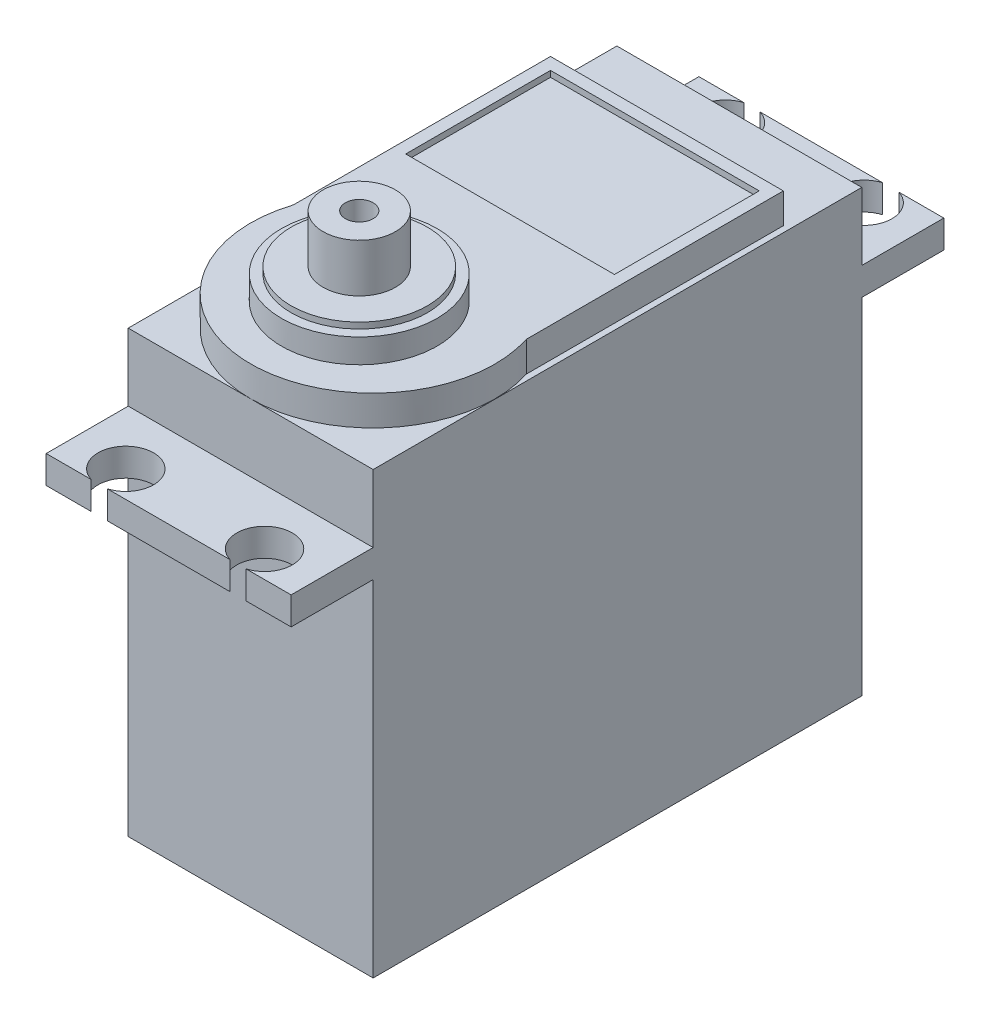
ISO-10303-21;
HEADER;
FILE_DESCRIPTION(('STEP AP214'),'2;1');
FILE_NAME('part.step','',(''),(''),'','','');
FILE_SCHEMA(('AUTOMOTIVE_DESIGN { 1 0 10303 214 1 1 1 1 }'));
ENDSEC;
DATA;
#1=APPLICATION_CONTEXT('core data for automotive mechanical design processes');
#2=APPLICATION_PROTOCOL_DEFINITION('international standard','automotive_design',2000,#1);
#3=PRODUCT_CONTEXT('',#1,'mechanical');
#4=PRODUCT('Part','Part','',(#3));
#5=PRODUCT_RELATED_PRODUCT_CATEGORY('part','',(#4));
#6=PRODUCT_DEFINITION_FORMATION('','',#4);
#7=PRODUCT_DEFINITION_CONTEXT('part definition',#1,'design');
#8=PRODUCT_DEFINITION('design','',#6,#7);
#9=PRODUCT_DEFINITION_SHAPE('','',#8);
#10=(LENGTH_UNIT() NAMED_UNIT(*) SI_UNIT(.MILLI.,.METRE.));
#11=(NAMED_UNIT(*) PLANE_ANGLE_UNIT() SI_UNIT($,.RADIAN.));
#12=(NAMED_UNIT(*) SI_UNIT($,.STERADIAN.) SOLID_ANGLE_UNIT());
#13=UNCERTAINTY_MEASURE_WITH_UNIT(LENGTH_MEASURE(1.E-05),#10,'distance_accuracy_value','');
#14=(GEOMETRIC_REPRESENTATION_CONTEXT(3) GLOBAL_UNCERTAINTY_ASSIGNED_CONTEXT((#13)) GLOBAL_UNIT_ASSIGNED_CONTEXT((#10,
#11,#12)) REPRESENTATION_CONTEXT('',''));
#15=CARTESIAN_POINT('',(0.,0.,0.));
#16=DIRECTION('',(0.,0.,1.));
#17=DIRECTION('',(1.,0.,0.));
#18=AXIS2_PLACEMENT_3D('',#15,#16,#17);
#19=CARTESIAN_POINT('',(-10.15,30.9,-27.05));
#20=DIRECTION('',(0.,-1.,0.));
#21=DIRECTION('',(0.,0.,-1.));
#22=AXIS2_PLACEMENT_3D('',#19,#20,#21);
#23=PLANE('',#22);
#24=DIRECTION('',(1.,0.,0.));
#25=VECTOR('',#24,1.);
#26=CARTESIAN_POINT('',(-10.15,30.9,-27.05));
#27=LINE('',#26,#25);
#28=CARTESIAN_POINT('',(-5.07917960675002,30.9,-27.05));
#29=VERTEX_POINT('',#28);
#30=CARTESIAN_POINT('',(5.07917960675007,30.9,-27.05));
#31=VERTEX_POINT('',#30);
#32=EDGE_CURVE('E347',#29,#31,#27,.T.);
#33=ORIENTED_EDGE('',*,*,#32,.F.);
#34=CARTESIAN_POINT('',(-5.74999999999999,30.9,-24.85));
#35=DIRECTION('',(0.,-1.,0.));
#36=DIRECTION('',(0.,0.,-1.));
#37=AXIS2_PLACEMENT_3D('',#34,#35,#36);
#38=CIRCLE('',#37,2.3);
#39=CARTESIAN_POINT('',(-6.42082039324996,30.9,-27.05));
#40=VERTEX_POINT('',#39);
#41=EDGE_CURVE('E311',#40,#29,#38,.F.);
#42=ORIENTED_EDGE('',*,*,#41,.F.);
#43=CARTESIAN_POINT('',(-10.15,30.9,-27.05));
#44=VERTEX_POINT('',#43);
#45=EDGE_CURVE('E343',#44,#40,#27,.T.);
#46=ORIENTED_EDGE('',*,*,#45,.F.);
#47=DIRECTION('',(0.,0.,1.));
#48=VECTOR('',#47,1.);
#49=CARTESIAN_POINT('',(-10.15,30.9,-27.05));
#50=LINE('',#49,#48);
#51=CARTESIAN_POINT('',(-10.15,30.9,-20.25));
#52=VERTEX_POINT('',#51);
#53=EDGE_CURVE('E352',#44,#52,#50,.T.);
#54=ORIENTED_EDGE('',*,*,#53,.T.);
#55=DIRECTION('',(1.,0.,0.));
#56=VECTOR('',#55,1.);
#57=CARTESIAN_POINT('',(-10.15,30.9,-20.25));
#58=LINE('',#57,#56);
#59=CARTESIAN_POINT('',(10.15,30.9,-20.25));
#60=VERTEX_POINT('',#59);
#61=EDGE_CURVE('E335',#52,#60,#58,.T.);
#62=ORIENTED_EDGE('',*,*,#61,.T.);
#63=DIRECTION('',(0.,0.,1.));
#64=VECTOR('',#63,1.);
#65=CARTESIAN_POINT('',(10.15,30.9,-27.05));
#66=LINE('',#65,#64);
#67=CARTESIAN_POINT('',(10.15,30.9,-27.05));
#68=VERTEX_POINT('',#67);
#69=EDGE_CURVE('E356',#68,#60,#66,.T.);
#70=ORIENTED_EDGE('',*,*,#69,.F.);
#71=CARTESIAN_POINT('',(6.42082039324993,30.9,-27.05));
#72=VERTEX_POINT('',#71);
#73=EDGE_CURVE('E342',#72,#68,#27,.T.);
#74=ORIENTED_EDGE('',*,*,#73,.F.);
#75=CARTESIAN_POINT('',(5.75,30.9,-24.85));
#76=DIRECTION('',(0.,-1.,0.));
#77=DIRECTION('',(0.,0.,-1.));
#78=AXIS2_PLACEMENT_3D('',#75,#76,#77);
#79=CIRCLE('',#78,2.3);
#80=EDGE_CURVE('E318',#72,#31,#79,.T.);
#81=ORIENTED_EDGE('',*,*,#80,.T.);
#82=EDGE_LOOP('',(#33,#42,#46,#54,#62,#70,#74,#81));
#83=FACE_BOUND('',#82,.T.);
#84=ADVANCED_FACE('F34',(#83),#23,.F.);
#85=CARTESIAN_POINT('',(10.15,28.6,-27.05));
#86=DIRECTION('',(0.,1.,0.));
#87=DIRECTION('',(0.,0.,1.));
#88=AXIS2_PLACEMENT_3D('',#85,#86,#87);
#89=PLANE('',#88);
#90=DIRECTION('',(-1.,0.,0.));
#91=VECTOR('',#90,1.);
#92=CARTESIAN_POINT('',(10.15,28.6,-27.05));
#93=LINE('',#92,#91);
#94=CARTESIAN_POINT('',(-6.42082039324996,28.6,-27.05));
#95=VERTEX_POINT('',#94);
#96=CARTESIAN_POINT('',(-10.15,28.6,-27.05));
#97=VERTEX_POINT('',#96);
#98=EDGE_CURVE('E334',#95,#97,#93,.T.);
#99=ORIENTED_EDGE('',*,*,#98,.F.);
#100=CARTESIAN_POINT('',(-5.74999999999999,28.6,-24.85));
#101=DIRECTION('',(0.,1.,0.));
#102=DIRECTION('',(0.,0.,1.));
#103=AXIS2_PLACEMENT_3D('',#100,#101,#102);
#104=CIRCLE('',#103,2.3);
#105=CARTESIAN_POINT('',(-5.07917960675002,28.6,-27.05));
#106=VERTEX_POINT('',#105);
#107=EDGE_CURVE('E315',#106,#95,#104,.F.);
#108=ORIENTED_EDGE('',*,*,#107,.F.);
#109=CARTESIAN_POINT('',(5.07917960675007,28.6,-27.05));
#110=VERTEX_POINT('',#109);
#111=EDGE_CURVE('E340',#110,#106,#93,.T.);
#112=ORIENTED_EDGE('',*,*,#111,.F.);
#113=CARTESIAN_POINT('',(5.75,28.6,-24.85));
#114=DIRECTION('',(0.,1.,0.));
#115=DIRECTION('',(0.,0.,1.));
#116=AXIS2_PLACEMENT_3D('',#113,#114,#115);
#117=CIRCLE('',#116,2.3);
#118=CARTESIAN_POINT('',(6.42082039324993,28.6,-27.05));
#119=VERTEX_POINT('',#118);
#120=EDGE_CURVE('E303',#110,#119,#117,.T.);
#121=ORIENTED_EDGE('',*,*,#120,.T.);
#122=CARTESIAN_POINT('',(10.15,28.6,-27.05));
#123=VERTEX_POINT('',#122);
#124=EDGE_CURVE('E336',#123,#119,#93,.T.);
#125=ORIENTED_EDGE('',*,*,#124,.F.);
#126=DIRECTION('',(0.,0.,1.));
#127=VECTOR('',#126,1.);
#128=CARTESIAN_POINT('',(10.15,28.6,-27.05));
#129=LINE('',#128,#127);
#130=CARTESIAN_POINT('',(10.15,28.6,-20.25));
#131=VERTEX_POINT('',#130);
#132=EDGE_CURVE('E359',#123,#131,#129,.T.);
#133=ORIENTED_EDGE('',*,*,#132,.T.);
#134=DIRECTION('',(-1.,0.,0.));
#135=VECTOR('',#134,1.);
#136=CARTESIAN_POINT('',(10.15,28.6,-20.25));
#137=LINE('',#136,#135);
#138=CARTESIAN_POINT('',(-10.15,28.6,-20.25));
#139=VERTEX_POINT('',#138);
#140=EDGE_CURVE('E313',#131,#139,#137,.T.);
#141=ORIENTED_EDGE('',*,*,#140,.T.);
#142=DIRECTION('',(0.,0.,1.));
#143=VECTOR('',#142,1.);
#144=CARTESIAN_POINT('',(-10.15,28.6,-27.05));
#145=LINE('',#144,#143);
#146=EDGE_CURVE('E346',#97,#139,#145,.T.);
#147=ORIENTED_EDGE('',*,*,#146,.F.);
#148=EDGE_LOOP('',(#99,#108,#112,#121,#125,#133,#141,#147));
#149=FACE_BOUND('',#148,.T.);
#150=ADVANCED_FACE('F474',(#149),#89,.F.);
#151=CARTESIAN_POINT('',(0.,0.,-27.05));
#152=DIRECTION('',(0.,0.,1.));
#153=DIRECTION('',(-1.,0.,0.));
#154=AXIS2_PLACEMENT_3D('',#151,#152,#153);
#155=PLANE('',#154);
#156=ORIENTED_EDGE('',*,*,#111,.T.);
#157=DIRECTION('',(0.,1.,0.));
#158=VECTOR('',#157,1.);
#159=CARTESIAN_POINT('',(-5.07917960675002,-0.00199999999999853,-27.05));
#160=LINE('',#159,#158);
#161=EDGE_CURVE('E317',#106,#29,#160,.T.);
#162=ORIENTED_EDGE('',*,*,#161,.T.);
#163=ORIENTED_EDGE('',*,*,#32,.T.);
#164=DIRECTION('',(0.,1.,0.));
#165=VECTOR('',#164,1.);
#166=CARTESIAN_POINT('',(5.07917960675007,-0.00199999999999853,-27.05));
#167=LINE('',#166,#165);
#168=EDGE_CURVE('E327',#110,#31,#167,.T.);
#169=ORIENTED_EDGE('',*,*,#168,.F.);
#170=EDGE_LOOP('',(#156,#162,#163,#169));
#171=FACE_BOUND('',#170,.T.);
#172=ADVANCED_FACE('F539',(#171),#155,.F.);
#173=DIRECTION('',(0.,1.,0.));
#174=VECTOR('',#173,1.);
#175=CARTESIAN_POINT('',(6.42082039324993,-0.00199999999999853,-27.05));
#176=LINE('',#175,#174);
#177=EDGE_CURVE('E324',#119,#72,#176,.T.);
#178=ORIENTED_EDGE('',*,*,#177,.T.);
#179=ORIENTED_EDGE('',*,*,#73,.T.);
#180=DIRECTION('',(0.,-1.,0.));
#181=VECTOR('',#180,1.);
#182=CARTESIAN_POINT('',(10.15,30.9,-27.05));
#183=LINE('',#182,#181);
#184=EDGE_CURVE('E339',#68,#123,#183,.T.);
#185=ORIENTED_EDGE('',*,*,#184,.T.);
#186=ORIENTED_EDGE('',*,*,#124,.T.);
#187=EDGE_LOOP('',(#178,#179,#185,#186));
#188=FACE_BOUND('',#187,.T.);
#189=ADVANCED_FACE('F479',(#188),#155,.F.);
#190=ORIENTED_EDGE('',*,*,#45,.T.);
#191=DIRECTION('',(0.,1.,0.));
#192=VECTOR('',#191,1.);
#193=CARTESIAN_POINT('',(-6.42082039324996,-0.00199999999999853,-27.05));
#194=LINE('',#193,#192);
#195=EDGE_CURVE('E314',#95,#40,#194,.T.);
#196=ORIENTED_EDGE('',*,*,#195,.F.);
#197=ORIENTED_EDGE('',*,*,#98,.T.);
#198=DIRECTION('',(0.,1.,0.));
#199=VECTOR('',#198,1.);
#200=CARTESIAN_POINT('',(-10.15,28.6,-27.05));
#201=LINE('',#200,#199);
#202=EDGE_CURVE('E331',#97,#44,#201,.T.);
#203=ORIENTED_EDGE('',*,*,#202,.T.);
#204=EDGE_LOOP('',(#190,#196,#197,#203));
#205=FACE_BOUND('',#204,.T.);
#206=ADVANCED_FACE('F799',(#205),#155,.F.);
#207=CARTESIAN_POINT('',(-10.15,36.5,-20.25));
#208=DIRECTION('',(0.,0.,1.));
#209=DIRECTION('',(1.,0.,0.));
#210=AXIS2_PLACEMENT_3D('',#207,#208,#209);
#211=PLANE('',#210);
#212=ORIENTED_EDGE('',*,*,#140,.F.);
#213=DIRECTION('',(0.,-1.,0.));
#214=VECTOR('',#213,1.);
#215=CARTESIAN_POINT('',(10.15,36.5,-20.25));
#216=LINE('',#215,#214);
#217=CARTESIAN_POINT('',(10.15,0.,-20.25));
#218=VERTEX_POINT('',#217);
#219=EDGE_CURVE('E447',#131,#218,#216,.T.);
#220=ORIENTED_EDGE('',*,*,#219,.T.);
#221=DIRECTION('',(-1.,0.,0.));
#222=VECTOR('',#221,1.);
#223=CARTESIAN_POINT('',(-10.15,0.,-20.25));
#224=LINE('',#223,#222);
#225=CARTESIAN_POINT('',(-10.15,0.,-20.25));
#226=VERTEX_POINT('',#225);
#227=EDGE_CURVE('E429',#218,#226,#224,.T.);
#228=ORIENTED_EDGE('',*,*,#227,.T.);
#229=DIRECTION('',(0.,-1.,0.));
#230=VECTOR('',#229,1.);
#231=CARTESIAN_POINT('',(-10.15,36.5,-20.25));
#232=LINE('',#231,#230);
#233=EDGE_CURVE('E444',#139,#226,#232,.T.);
#234=ORIENTED_EDGE('',*,*,#233,.F.);
#235=EDGE_LOOP('',(#212,#220,#228,#234));
#236=FACE_BOUND('',#235,.T.);
#237=ADVANCED_FACE('F454',(#236),#211,.F.);
#238=ORIENTED_EDGE('',*,*,#61,.F.);
#239=CARTESIAN_POINT('',(-10.15,36.5,-20.25));
#240=VERTEX_POINT('',#239);
#241=EDGE_CURVE('E445',#240,#52,#232,.T.);
#242=ORIENTED_EDGE('',*,*,#241,.F.);
#243=DIRECTION('',(-1.,0.,0.));
#244=VECTOR('',#243,1.);
#245=CARTESIAN_POINT('',(-10.15,36.5,-20.25));
#246=LINE('',#245,#244);
#247=CARTESIAN_POINT('',(10.15,36.5,-20.25));
#248=VERTEX_POINT('',#247);
#249=EDGE_CURVE('E417',#248,#240,#246,.T.);
#250=ORIENTED_EDGE('',*,*,#249,.F.);
#251=EDGE_CURVE('E448',#248,#60,#216,.T.);
#252=ORIENTED_EDGE('',*,*,#251,.T.);
#253=EDGE_LOOP('',(#238,#242,#250,#252));
#254=FACE_BOUND('',#253,.T.);
#255=ADVANCED_FACE('F485',(#254),#211,.F.);
#256=CARTESIAN_POINT('',(10.15,28.6,27.05));
#257=DIRECTION('',(0.,-1.,0.));
#258=DIRECTION('',(0.,0.,-1.));
#259=AXIS2_PLACEMENT_3D('',#256,#257,#258);
#260=PLANE('',#259);
#261=DIRECTION('',(-1.,0.,0.));
#262=VECTOR('',#261,1.);
#263=CARTESIAN_POINT('',(10.15,28.6,27.05));
#264=LINE('',#263,#262);
#265=CARTESIAN_POINT('',(5.07917960675007,28.6,27.05));
#266=VERTEX_POINT('',#265);
#267=CARTESIAN_POINT('',(-5.07917960675003,28.6,27.05));
#268=VERTEX_POINT('',#267);
#269=EDGE_CURVE('E401',#266,#268,#264,.T.);
#270=ORIENTED_EDGE('',*,*,#269,.T.);
#271=CARTESIAN_POINT('',(-5.74999999999999,28.6,24.85));
#272=DIRECTION('',(0.,-1.,0.));
#273=DIRECTION('',(0.,0.,-1.));
#274=AXIS2_PLACEMENT_3D('',#271,#272,#273);
#275=CIRCLE('',#274,2.3);
#276=CARTESIAN_POINT('',(-6.42082039324996,28.6,27.05));
#277=VERTEX_POINT('',#276);
#278=EDGE_CURVE('E369',#277,#268,#275,.T.);
#279=ORIENTED_EDGE('',*,*,#278,.F.);
#280=CARTESIAN_POINT('',(-10.15,28.6,27.05));
#281=VERTEX_POINT('',#280);
#282=EDGE_CURVE('E396',#277,#281,#264,.T.);
#283=ORIENTED_EDGE('',*,*,#282,.T.);
#284=DIRECTION('',(0.,0.,-1.));
#285=VECTOR('',#284,1.);
#286=CARTESIAN_POINT('',(-10.15,28.6,27.05));
#287=LINE('',#286,#285);
#288=CARTESIAN_POINT('',(-10.15,28.6,20.25));
#289=VERTEX_POINT('',#288);
#290=EDGE_CURVE('E406',#281,#289,#287,.T.);
#291=ORIENTED_EDGE('',*,*,#290,.T.);
#292=DIRECTION('',(-1.,0.,0.));
#293=VECTOR('',#292,1.);
#294=CARTESIAN_POINT('',(10.15,28.6,20.25));
#295=LINE('',#294,#293);
#296=CARTESIAN_POINT('',(10.15,28.6,20.25));
#297=VERTEX_POINT('',#296);
#298=EDGE_CURVE('E388',#297,#289,#295,.T.);
#299=ORIENTED_EDGE('',*,*,#298,.F.);
#300=DIRECTION('',(0.,0.,-1.));
#301=VECTOR('',#300,1.);
#302=CARTESIAN_POINT('',(10.15,28.6,27.05));
#303=LINE('',#302,#301);
#304=CARTESIAN_POINT('',(10.15,28.6,27.05));
#305=VERTEX_POINT('',#304);
#306=EDGE_CURVE('E409',#305,#297,#303,.T.);
#307=ORIENTED_EDGE('',*,*,#306,.F.);
#308=CARTESIAN_POINT('',(6.42082039324993,28.6,27.05));
#309=VERTEX_POINT('',#308);
#310=EDGE_CURVE('E397',#305,#309,#264,.T.);
#311=ORIENTED_EDGE('',*,*,#310,.T.);
#312=CARTESIAN_POINT('',(5.75,28.6,24.85));
#313=DIRECTION('',(0.,-1.,0.));
#314=DIRECTION('',(0.,0.,-1.));
#315=AXIS2_PLACEMENT_3D('',#312,#313,#314);
#316=CIRCLE('',#315,2.3);
#317=EDGE_CURVE('E355',#309,#266,#316,.F.);
#318=ORIENTED_EDGE('',*,*,#317,.T.);
#319=EDGE_LOOP('',(#270,#279,#283,#291,#299,#307,#311,#318));
#320=FACE_BOUND('',#319,.T.);
#321=ADVANCED_FACE('F516',(#320),#260,.T.);
#322=CARTESIAN_POINT('',(-10.15,30.9,27.05));
#323=DIRECTION('',(0.,1.,0.));
#324=DIRECTION('',(0.,0.,1.));
#325=AXIS2_PLACEMENT_3D('',#322,#323,#324);
#326=PLANE('',#325);
#327=DIRECTION('',(1.,0.,0.));
#328=VECTOR('',#327,1.);
#329=CARTESIAN_POINT('',(-10.15,30.9,27.05));
#330=LINE('',#329,#328);
#331=CARTESIAN_POINT('',(-10.15,30.9,27.05));
#332=VERTEX_POINT('',#331);
#333=CARTESIAN_POINT('',(-6.42082039324996,30.9,27.05));
#334=VERTEX_POINT('',#333);
#335=EDGE_CURVE('E389',#332,#334,#330,.T.);
#336=ORIENTED_EDGE('',*,*,#335,.T.);
#337=CARTESIAN_POINT('',(-5.74999999999999,30.9,24.85));
#338=DIRECTION('',(0.,1.,0.));
#339=DIRECTION('',(0.,0.,1.));
#340=AXIS2_PLACEMENT_3D('',#337,#338,#339);
#341=CIRCLE('',#340,2.3);
#342=CARTESIAN_POINT('',(-5.07917960675002,30.9,27.05));
#343=VERTEX_POINT('',#342);
#344=EDGE_CURVE('E364',#334,#343,#341,.F.);
#345=ORIENTED_EDGE('',*,*,#344,.T.);
#346=CARTESIAN_POINT('',(5.07917960675007,30.9,27.05));
#347=VERTEX_POINT('',#346);
#348=EDGE_CURVE('E393',#343,#347,#330,.T.);
#349=ORIENTED_EDGE('',*,*,#348,.T.);
#350=CARTESIAN_POINT('',(5.75,30.9,24.85));
#351=DIRECTION('',(0.,1.,0.));
#352=DIRECTION('',(0.,0.,1.));
#353=AXIS2_PLACEMENT_3D('',#350,#351,#352);
#354=CIRCLE('',#353,2.3);
#355=CARTESIAN_POINT('',(6.42082039324993,30.9,27.05));
#356=VERTEX_POINT('',#355);
#357=EDGE_CURVE('E372',#356,#347,#354,.T.);
#358=ORIENTED_EDGE('',*,*,#357,.F.);
#359=CARTESIAN_POINT('',(10.15,30.9,27.05));
#360=VERTEX_POINT('',#359);
#361=EDGE_CURVE('E387',#356,#360,#330,.T.);
#362=ORIENTED_EDGE('',*,*,#361,.T.);
#363=DIRECTION('',(0.,0.,-1.));
#364=VECTOR('',#363,1.);
#365=CARTESIAN_POINT('',(10.15,30.9,27.05));
#366=LINE('',#365,#364);
#367=CARTESIAN_POINT('',(10.15,30.9,20.25));
#368=VERTEX_POINT('',#367);
#369=EDGE_CURVE('E411',#360,#368,#366,.T.);
#370=ORIENTED_EDGE('',*,*,#369,.T.);
#371=DIRECTION('',(1.,0.,0.));
#372=VECTOR('',#371,1.);
#373=CARTESIAN_POINT('',(-10.15,30.9,20.25));
#374=LINE('',#373,#372);
#375=CARTESIAN_POINT('',(-10.15,30.9,20.25));
#376=VERTEX_POINT('',#375);
#377=EDGE_CURVE('E367',#376,#368,#374,.T.);
#378=ORIENTED_EDGE('',*,*,#377,.F.);
#379=DIRECTION('',(0.,0.,-1.));
#380=VECTOR('',#379,1.);
#381=CARTESIAN_POINT('',(-10.15,30.9,27.05));
#382=LINE('',#381,#380);
#383=EDGE_CURVE('E400',#332,#376,#382,.T.);
#384=ORIENTED_EDGE('',*,*,#383,.F.);
#385=EDGE_LOOP('',(#336,#345,#349,#358,#362,#370,#378,#384));
#386=FACE_BOUND('',#385,.T.);
#387=ADVANCED_FACE('F500',(#386),#326,.T.);
#388=CARTESIAN_POINT('',(0.,0.,27.05));
#389=DIRECTION('',(0.,0.,-1.));
#390=DIRECTION('',(-1.,0.,0.));
#391=AXIS2_PLACEMENT_3D('',#388,#389,#390);
#392=PLANE('',#391);
#393=DIRECTION('',(0.,1.,0.));
#394=VECTOR('',#393,1.);
#395=CARTESIAN_POINT('',(-6.42082039324996,-0.00199999999999853,27.05));
#396=LINE('',#395,#394);
#397=EDGE_CURVE('E371',#277,#334,#396,.T.);
#398=ORIENTED_EDGE('',*,*,#397,.T.);
#399=ORIENTED_EDGE('',*,*,#335,.F.);
#400=DIRECTION('',(0.,1.,0.));
#401=VECTOR('',#400,1.);
#402=CARTESIAN_POINT('',(-10.15,28.6,27.05));
#403=LINE('',#402,#401);
#404=EDGE_CURVE('E384',#281,#332,#403,.T.);
#405=ORIENTED_EDGE('',*,*,#404,.F.);
#406=ORIENTED_EDGE('',*,*,#282,.F.);
#407=EDGE_LOOP('',(#398,#399,#405,#406));
#408=FACE_BOUND('',#407,.T.);
#409=ADVANCED_FACE('F522',(#408),#392,.F.);
#410=DIRECTION('',(0.,1.,0.));
#411=VECTOR('',#410,1.);
#412=CARTESIAN_POINT('',(-5.07917960675002,-0.00199999999999853,27.05));
#413=LINE('',#412,#411);
#414=EDGE_CURVE('E368',#268,#343,#413,.T.);
#415=ORIENTED_EDGE('',*,*,#414,.F.);
#416=ORIENTED_EDGE('',*,*,#269,.F.);
#417=DIRECTION('',(0.,1.,0.));
#418=VECTOR('',#417,1.);
#419=CARTESIAN_POINT('',(5.07917960675007,-0.00199999999999853,27.05));
#420=LINE('',#419,#418);
#421=EDGE_CURVE('E377',#266,#347,#420,.T.);
#422=ORIENTED_EDGE('',*,*,#421,.T.);
#423=ORIENTED_EDGE('',*,*,#348,.F.);
#424=EDGE_LOOP('',(#415,#416,#422,#423));
#425=FACE_BOUND('',#424,.T.);
#426=ADVANCED_FACE('F510',(#425),#392,.F.);
#427=CARTESIAN_POINT('',(-10.15,36.5,20.25));
#428=DIRECTION('',(0.,0.,-1.));
#429=DIRECTION('',(-1.,0.,0.));
#430=AXIS2_PLACEMENT_3D('',#427,#428,#429);
#431=PLANE('',#430);
#432=DIRECTION('',(0.,-1.,0.));
#433=VECTOR('',#432,1.);
#434=CARTESIAN_POINT('',(-10.15,36.5,20.25));
#435=LINE('',#434,#433);
#436=CARTESIAN_POINT('',(-10.15,36.5,20.25));
#437=VERTEX_POINT('',#436);
#438=EDGE_CURVE('E441',#437,#376,#435,.T.);
#439=ORIENTED_EDGE('',*,*,#438,.T.);
#440=ORIENTED_EDGE('',*,*,#377,.T.);
#441=DIRECTION('',(0.,-1.,0.));
#442=VECTOR('',#441,1.);
#443=CARTESIAN_POINT('',(10.15,36.5,20.25));
#444=LINE('',#443,#442);
#445=CARTESIAN_POINT('',(10.15,36.5,20.25));
#446=VERTEX_POINT('',#445);
#447=EDGE_CURVE('E437',#446,#368,#444,.T.);
#448=ORIENTED_EDGE('',*,*,#447,.F.);
#449=DIRECTION('',(1.,0.,0.));
#450=VECTOR('',#449,1.);
#451=CARTESIAN_POINT('',(-10.15,36.5,20.25));
#452=LINE('',#451,#450);
#453=CARTESIAN_POINT('',(0.,36.5,20.25));
#454=VERTEX_POINT('',#453);
#455=EDGE_CURVE('E422',#454,#446,#452,.T.);
#456=ORIENTED_EDGE('',*,*,#455,.F.);
#457=EDGE_CURVE('E423',#437,#454,#452,.T.);
#458=ORIENTED_EDGE('',*,*,#457,.F.);
#459=EDGE_LOOP('',(#439,#440,#448,#456,#458));
#460=FACE_BOUND('',#459,.T.);
#461=ADVANCED_FACE('F497',(#460),#431,.F.);
#462=CARTESIAN_POINT('',(10.15,36.5,20.25));
#463=DIRECTION('',(-1.,0.,0.));
#464=DIRECTION('',(0.,0.,1.));
#465=AXIS2_PLACEMENT_3D('',#462,#463,#464);
#466=PLANE('',#465);
#467=DIRECTION('',(0.,0.,-1.));
#468=VECTOR('',#467,1.);
#469=CARTESIAN_POINT('',(10.15,0.,20.25));
#470=LINE('',#469,#468);
#471=CARTESIAN_POINT('',(10.15,0.,20.25));
#472=VERTEX_POINT('',#471);
#473=EDGE_CURVE('E408',#472,#218,#470,.T.);
#474=ORIENTED_EDGE('',*,*,#473,.T.);
#475=ORIENTED_EDGE('',*,*,#219,.F.);
#476=ORIENTED_EDGE('',*,*,#132,.F.);
#477=ORIENTED_EDGE('',*,*,#184,.F.);
#478=ORIENTED_EDGE('',*,*,#69,.T.);
#479=ORIENTED_EDGE('',*,*,#251,.F.);
#480=DIRECTION('',(0.,0.,-1.));
#481=VECTOR('',#480,1.);
#482=CARTESIAN_POINT('',(10.15,36.5,20.25));
#483=LINE('',#482,#481);
#484=EDGE_CURVE('E414',#446,#248,#483,.T.);
#485=ORIENTED_EDGE('',*,*,#484,.F.);
#486=ORIENTED_EDGE('',*,*,#447,.T.);
#487=ORIENTED_EDGE('',*,*,#369,.F.);
#488=DIRECTION('',(0.,-1.,0.));
#489=VECTOR('',#488,1.);
#490=CARTESIAN_POINT('',(10.15,30.9,27.05));
#491=LINE('',#490,#489);
#492=EDGE_CURVE('E392',#360,#305,#491,.T.);
#493=ORIENTED_EDGE('',*,*,#492,.T.);
#494=ORIENTED_EDGE('',*,*,#306,.T.);
#495=EDGE_CURVE('E426',#297,#472,#444,.T.);
#496=ORIENTED_EDGE('',*,*,#495,.T.);
#497=EDGE_LOOP('',(#474,#475,#476,#477,#478,#479,#485,#486,#487,#493,#494,#496));
#498=FACE_BOUND('',#497,.T.);
#499=ADVANCED_FACE('F36',(#498),#466,.F.);
#500=CARTESIAN_POINT('',(-10.15,36.5,20.25));
#501=DIRECTION('',(1.,0.,0.));
#502=DIRECTION('',(0.,0.,-1.));
#503=AXIS2_PLACEMENT_3D('',#500,#501,#502);
#504=PLANE('',#503);
#505=DIRECTION('',(0.,0.,1.));
#506=VECTOR('',#505,1.);
#507=CARTESIAN_POINT('',(-10.15,0.,20.25));
#508=LINE('',#507,#506);
#509=CARTESIAN_POINT('',(-10.15,0.,20.25));
#510=VERTEX_POINT('',#509);
#511=EDGE_CURVE('E432',#226,#510,#508,.T.);
#512=ORIENTED_EDGE('',*,*,#511,.T.);
#513=EDGE_CURVE('E440',#289,#510,#435,.T.);
#514=ORIENTED_EDGE('',*,*,#513,.F.);
#515=ORIENTED_EDGE('',*,*,#290,.F.);
#516=ORIENTED_EDGE('',*,*,#404,.T.);
#517=ORIENTED_EDGE('',*,*,#383,.T.);
#518=ORIENTED_EDGE('',*,*,#438,.F.);
#519=DIRECTION('',(0.,0.,1.));
#520=VECTOR('',#519,1.);
#521=CARTESIAN_POINT('',(-10.15,36.5,20.25));
#522=LINE('',#521,#520);
#523=EDGE_CURVE('E420',#240,#437,#522,.T.);
#524=ORIENTED_EDGE('',*,*,#523,.F.);
#525=ORIENTED_EDGE('',*,*,#241,.T.);
#526=ORIENTED_EDGE('',*,*,#53,.F.);
#527=ORIENTED_EDGE('',*,*,#202,.F.);
#528=ORIENTED_EDGE('',*,*,#146,.T.);
#529=ORIENTED_EDGE('',*,*,#233,.T.);
#530=EDGE_LOOP('',(#512,#514,#515,#516,#517,#518,#524,#525,#526,#527,#528,#529));
#531=FACE_BOUND('',#530,.T.);
#532=ADVANCED_FACE('F469',(#531),#504,.F.);
#533=ORIENTED_EDGE('',*,*,#495,.F.);
#534=ORIENTED_EDGE('',*,*,#298,.T.);
#535=ORIENTED_EDGE('',*,*,#513,.T.);
#536=DIRECTION('',(1.,0.,0.));
#537=VECTOR('',#536,1.);
#538=CARTESIAN_POINT('',(-10.15,0.,20.25));
#539=LINE('',#538,#537);
#540=EDGE_CURVE('E418',#510,#472,#539,.T.);
#541=ORIENTED_EDGE('',*,*,#540,.T.);
#542=EDGE_LOOP('',(#533,#534,#535,#541));
#543=FACE_BOUND('',#542,.T.);
#544=ADVANCED_FACE('F465',(#543),#431,.F.);
#545=CARTESIAN_POINT('',(0.,36.5,0.));
#546=DIRECTION('',(0.,-1.,0.));
#547=DIRECTION('',(0.,0.,-1.));
#548=AXIS2_PLACEMENT_3D('',#545,#546,#547);
#549=PLANE('',#548);
#550=DIRECTION('',(-1.,0.,0.));
#551=VECTOR('',#550,1.);
#552=CARTESIAN_POINT('',(9.65,36.5,-14.25));
#553=LINE('',#552,#551);
#554=CARTESIAN_POINT('',(9.65,36.5,-14.25));
#555=VERTEX_POINT('',#554);
#556=CARTESIAN_POINT('',(-9.65,36.5,-14.25));
#557=VERTEX_POINT('',#556);
#558=EDGE_CURVE('E283',#555,#557,#553,.T.);
#559=ORIENTED_EDGE('',*,*,#558,.F.);
#560=DIRECTION('',(0.,0.,1.));
#561=VECTOR('',#560,1.);
#562=CARTESIAN_POINT('',(9.65,36.5,-14.25));
#563=LINE('',#562,#561);
#564=CARTESIAN_POINT('',(9.65,36.5,7.05));
#565=VERTEX_POINT('',#564);
#566=EDGE_CURVE('E59',#555,#565,#563,.T.);
#567=ORIENTED_EDGE('',*,*,#566,.T.);
#568=CARTESIAN_POINT('',(0.,36.5,10.1226325757576));
#569=DIRECTION('',(0.,-1.,0.));
#570=DIRECTION('',(0.,0.,-1.));
#571=AXIS2_PLACEMENT_3D('',#568,#569,#570);
#572=CIRCLE('',#571,10.1273674242424);
#573=EDGE_CURVE('E292',#565,#454,#572,.T.);
#574=ORIENTED_EDGE('',*,*,#573,.T.);
#575=ORIENTED_EDGE('',*,*,#455,.T.);
#576=ORIENTED_EDGE('',*,*,#484,.T.);
#577=ORIENTED_EDGE('',*,*,#249,.T.);
#578=ORIENTED_EDGE('',*,*,#523,.T.);
#579=ORIENTED_EDGE('',*,*,#457,.T.);
#580=CARTESIAN_POINT('',(-9.65,36.5,7.05));
#581=VERTEX_POINT('',#580);
#582=EDGE_CURVE('E295',#454,#581,#572,.T.);
#583=ORIENTED_EDGE('',*,*,#582,.T.);
#584=DIRECTION('',(0.,0.,1.));
#585=VECTOR('',#584,1.);
#586=CARTESIAN_POINT('',(-9.65,36.5,-14.25));
#587=LINE('',#586,#585);
#588=EDGE_CURVE('E294',#557,#581,#587,.T.);
#589=ORIENTED_EDGE('',*,*,#588,.F.);
#590=EDGE_LOOP('',(#559,#567,#574,#575,#576,#577,#578,#579,#583,#589));
#591=FACE_BOUND('',#590,.T.);
#592=ADVANCED_FACE('F489',(#591),#549,.F.);
#593=CARTESIAN_POINT('',(0.,0.,0.));
#594=DIRECTION('',(0.,-1.,0.));
#595=DIRECTION('',(0.,0.,-1.));
#596=AXIS2_PLACEMENT_3D('',#593,#594,#595);
#597=PLANE('',#596);
#598=ORIENTED_EDGE('',*,*,#473,.F.);
#599=ORIENTED_EDGE('',*,*,#540,.F.);
#600=ORIENTED_EDGE('',*,*,#511,.F.);
#601=ORIENTED_EDGE('',*,*,#227,.F.);
#602=EDGE_LOOP('',(#598,#599,#600,#601));
#603=FACE_BOUND('',#602,.T.);
#604=ADVANCED_FACE('F460',(#603),#597,.T.);
#605=ORIENTED_EDGE('',*,*,#361,.F.);
#606=DIRECTION('',(0.,1.,0.));
#607=VECTOR('',#606,1.);
#608=CARTESIAN_POINT('',(6.42082039324993,-0.00199999999999853,27.05));
#609=LINE('',#608,#607);
#610=EDGE_CURVE('E380',#309,#356,#609,.T.);
#611=ORIENTED_EDGE('',*,*,#610,.F.);
#612=ORIENTED_EDGE('',*,*,#310,.F.);
#613=ORIENTED_EDGE('',*,*,#492,.F.);
#614=EDGE_LOOP('',(#605,#611,#612,#613));
#615=FACE_BOUND('',#614,.T.);
#616=ADVANCED_FACE('F519',(#615),#392,.F.);
#617=CARTESIAN_POINT('',(5.75,-0.00199999999999853,24.85));
#618=DIRECTION('',(0.,1.,0.));
#619=DIRECTION('',(0.,0.,1.));
#620=AXIS2_PLACEMENT_3D('',#617,#618,#619);
#621=CYLINDRICAL_SURFACE('',#620,2.3);
#622=ORIENTED_EDGE('',*,*,#610,.T.);
#623=ORIENTED_EDGE('',*,*,#357,.T.);
#624=ORIENTED_EDGE('',*,*,#421,.F.);
#625=ORIENTED_EDGE('',*,*,#317,.F.);
#626=EDGE_LOOP('',(#622,#623,#624,#625));
#627=FACE_BOUND('',#626,.T.);
#628=ADVANCED_FACE('F514',(#627),#621,.F.);
#629=CARTESIAN_POINT('',(-5.74999999999999,-0.00199999999999853,24.85));
#630=DIRECTION('',(0.,1.,0.));
#631=DIRECTION('',(0.,0.,1.));
#632=AXIS2_PLACEMENT_3D('',#629,#630,#631);
#633=CYLINDRICAL_SURFACE('',#632,2.3);
#634=ORIENTED_EDGE('',*,*,#278,.T.);
#635=ORIENTED_EDGE('',*,*,#414,.T.);
#636=ORIENTED_EDGE('',*,*,#344,.F.);
#637=ORIENTED_EDGE('',*,*,#397,.F.);
#638=EDGE_LOOP('',(#634,#635,#636,#637));
#639=FACE_BOUND('',#638,.T.);
#640=ADVANCED_FACE('F527',(#639),#633,.F.);
#641=CARTESIAN_POINT('',(5.75,-0.00199999999999853,-24.85));
#642=DIRECTION('',(0.,1.,0.));
#643=DIRECTION('',(0.,0.,1.));
#644=AXIS2_PLACEMENT_3D('',#641,#642,#643);
#645=CYLINDRICAL_SURFACE('',#644,2.3);
#646=ORIENTED_EDGE('',*,*,#168,.T.);
#647=ORIENTED_EDGE('',*,*,#80,.F.);
#648=ORIENTED_EDGE('',*,*,#177,.F.);
#649=ORIENTED_EDGE('',*,*,#120,.F.);
#650=EDGE_LOOP('',(#646,#647,#648,#649));
#651=FACE_BOUND('',#650,.T.);
#652=ADVANCED_FACE('F545',(#651),#645,.F.);
#653=CARTESIAN_POINT('',(-5.74999999999999,-0.00199999999999853,-24.85));
#654=DIRECTION('',(0.,1.,0.));
#655=DIRECTION('',(0.,0.,1.));
#656=AXIS2_PLACEMENT_3D('',#653,#654,#655);
#657=CYLINDRICAL_SURFACE('',#656,2.3);
#658=ORIENTED_EDGE('',*,*,#107,.T.);
#659=ORIENTED_EDGE('',*,*,#195,.T.);
#660=ORIENTED_EDGE('',*,*,#41,.T.);
#661=ORIENTED_EDGE('',*,*,#161,.F.);
#662=EDGE_LOOP('',(#658,#659,#660,#661));
#663=FACE_BOUND('',#662,.T.);
#664=ADVANCED_FACE('F550',(#663),#657,.F.);
#665=CARTESIAN_POINT('',(9.65,39.,-14.25));
#666=DIRECTION('',(1.,0.,0.));
#667=DIRECTION('',(0.,0.,-1.));
#668=AXIS2_PLACEMENT_3D('',#665,#666,#667);
#669=PLANE('',#668);
#670=ORIENTED_EDGE('',*,*,#566,.F.);
#671=DIRECTION('',(0.,-1.,0.));
#672=VECTOR('',#671,1.);
#673=CARTESIAN_POINT('',(9.65,39.,-14.25));
#674=LINE('',#673,#672);
#675=CARTESIAN_POINT('',(9.65,39.,-14.25));
#676=VERTEX_POINT('',#675);
#677=EDGE_CURVE('E300',#676,#555,#674,.T.);
#678=ORIENTED_EDGE('',*,*,#677,.F.);
#679=DIRECTION('',(0.,0.,1.));
#680=VECTOR('',#679,1.);
#681=CARTESIAN_POINT('',(9.65,39.,-14.25));
#682=LINE('',#681,#680);
#683=CARTESIAN_POINT('',(9.65,39.,7.05));
#684=VERTEX_POINT('',#683);
#685=EDGE_CURVE('E279',#676,#684,#682,.T.);
#686=ORIENTED_EDGE('',*,*,#685,.T.);
#687=DIRECTION('',(0.,-1.,0.));
#688=VECTOR('',#687,1.);
#689=CARTESIAN_POINT('',(9.65,39.,7.05));
#690=LINE('',#689,#688);
#691=EDGE_CURVE('E290',#684,#565,#690,.T.);
#692=ORIENTED_EDGE('',*,*,#691,.T.);
#693=EDGE_LOOP('',(#670,#678,#686,#692));
#694=FACE_BOUND('',#693,.T.);
#695=ADVANCED_FACE('F557',(#694),#669,.T.);
#696=CARTESIAN_POINT('',(9.65,39.,-14.25));
#697=DIRECTION('',(0.,0.,1.));
#698=DIRECTION('',(1.,0.,0.));
#699=AXIS2_PLACEMENT_3D('',#696,#697,#698);
#700=PLANE('',#699);
#701=ORIENTED_EDGE('',*,*,#558,.T.);
#702=DIRECTION('',(0.,-1.,0.));
#703=VECTOR('',#702,1.);
#704=CARTESIAN_POINT('',(-9.65,39.,-14.25));
#705=LINE('',#704,#703);
#706=CARTESIAN_POINT('',(-9.65,39.,-14.25));
#707=VERTEX_POINT('',#706);
#708=EDGE_CURVE('E304',#707,#557,#705,.T.);
#709=ORIENTED_EDGE('',*,*,#708,.F.);
#710=DIRECTION('',(-1.,0.,0.));
#711=VECTOR('',#710,1.);
#712=CARTESIAN_POINT('',(9.65,39.,-14.25));
#713=LINE('',#712,#711);
#714=EDGE_CURVE('E288',#676,#707,#713,.T.);
#715=ORIENTED_EDGE('',*,*,#714,.F.);
#716=ORIENTED_EDGE('',*,*,#677,.T.);
#717=EDGE_LOOP('',(#701,#709,#715,#716));
#718=FACE_BOUND('',#717,.T.);
#719=ADVANCED_FACE('F563',(#718),#700,.F.);
#720=CARTESIAN_POINT('',(-9.65,39.,-14.25));
#721=DIRECTION('',(1.,0.,0.));
#722=DIRECTION('',(0.,0.,-1.));
#723=AXIS2_PLACEMENT_3D('',#720,#721,#722);
#724=PLANE('',#723);
#725=ORIENTED_EDGE('',*,*,#588,.T.);
#726=DIRECTION('',(0.,-1.,0.));
#727=VECTOR('',#726,1.);
#728=CARTESIAN_POINT('',(-9.65,39.,7.05));
#729=LINE('',#728,#727);
#730=CARTESIAN_POINT('',(-9.65,39.,7.05));
#731=VERTEX_POINT('',#730);
#732=EDGE_CURVE('E307',#731,#581,#729,.T.);
#733=ORIENTED_EDGE('',*,*,#732,.F.);
#734=DIRECTION('',(0.,0.,1.));
#735=VECTOR('',#734,1.);
#736=CARTESIAN_POINT('',(-9.65,39.,-14.25));
#737=LINE('',#736,#735);
#738=EDGE_CURVE('E286',#707,#731,#737,.T.);
#739=ORIENTED_EDGE('',*,*,#738,.F.);
#740=ORIENTED_EDGE('',*,*,#708,.T.);
#741=EDGE_LOOP('',(#725,#733,#739,#740));
#742=FACE_BOUND('',#741,.T.);
#743=ADVANCED_FACE('F569',(#742),#724,.F.);
#744=CARTESIAN_POINT('',(0.,39.,10.1226325757576));
#745=DIRECTION('',(0.,-1.,0.));
#746=DIRECTION('',(0.,0.,-1.));
#747=AXIS2_PLACEMENT_3D('',#744,#745,#746);
#748=CYLINDRICAL_SURFACE('',#747,10.1273674242424);
#749=ORIENTED_EDGE('',*,*,#573,.F.);
#750=ORIENTED_EDGE('',*,*,#691,.F.);
#751=CARTESIAN_POINT('',(0.,39.,10.1226325757576));
#752=DIRECTION('',(0.,-1.,0.));
#753=DIRECTION('',(0.,0.,-1.));
#754=AXIS2_PLACEMENT_3D('',#751,#752,#753);
#755=CIRCLE('',#754,10.1273674242424);
#756=EDGE_CURVE('E282',#684,#731,#755,.T.);
#757=ORIENTED_EDGE('',*,*,#756,.T.);
#758=ORIENTED_EDGE('',*,*,#732,.T.);
#759=ORIENTED_EDGE('',*,*,#582,.F.);
#760=EDGE_LOOP('',(#749,#750,#757,#758,#759));
#761=FACE_BOUND('',#760,.T.);
#762=ADVANCED_FACE('F565',(#761),#748,.T.);
#763=CARTESIAN_POINT('',(0.,39.,10.1226325757576));
#764=DIRECTION('',(0.,-1.,0.));
#765=DIRECTION('',(0.,0.,-1.));
#766=AXIS2_PLACEMENT_3D('',#763,#764,#765);
#767=PLANE('',#766);
#768=DIRECTION('',(1.,0.,0.));
#769=VECTOR('',#768,1.);
#770=CARTESIAN_POINT('',(-8.65,39.,-1.25));
#771=LINE('',#770,#769);
#772=CARTESIAN_POINT('',(-8.65,39.,-1.25));
#773=VERTEX_POINT('',#772);
#774=CARTESIAN_POINT('',(8.65,39.,-1.25));
#775=VERTEX_POINT('',#774);
#776=EDGE_CURVE('E253',#773,#775,#771,.T.);
#777=ORIENTED_EDGE('',*,*,#776,.F.);
#778=DIRECTION('',(0.,0.,1.));
#779=VECTOR('',#778,1.);
#780=CARTESIAN_POINT('',(-8.65000000000001,39.,-13.25));
#781=LINE('',#780,#779);
#782=CARTESIAN_POINT('',(-8.65000000000001,39.,-13.25));
#783=VERTEX_POINT('',#782);
#784=EDGE_CURVE('E51',#783,#773,#781,.T.);
#785=ORIENTED_EDGE('',*,*,#784,.F.);
#786=DIRECTION('',(-1.,0.,0.));
#787=VECTOR('',#786,1.);
#788=CARTESIAN_POINT('',(-8.65000000000001,39.,-13.25));
#789=LINE('',#788,#787);
#790=CARTESIAN_POINT('',(8.65,39.,-13.25));
#791=VERTEX_POINT('',#790);
#792=EDGE_CURVE('E244',#791,#783,#789,.T.);
#793=ORIENTED_EDGE('',*,*,#792,.F.);
#794=DIRECTION('',(0.,0.,-1.));
#795=VECTOR('',#794,1.);
#796=CARTESIAN_POINT('',(8.65,39.,-13.25));
#797=LINE('',#796,#795);
#798=EDGE_CURVE('E247',#775,#791,#797,.T.);
#799=ORIENTED_EDGE('',*,*,#798,.F.);
#800=EDGE_LOOP('',(#777,#785,#793,#799));
#801=FACE_BOUND('',#800,.T.);
#802=CARTESIAN_POINT('',(0.,39.,11.25));
#803=DIRECTION('',(0.,-1.,0.));
#804=DIRECTION('',(0.,0.,-1.));
#805=AXIS2_PLACEMENT_3D('',#802,#803,#804);
#806=CIRCLE('',#805,6.45);
#807=CARTESIAN_POINT('',(0.,39.,4.8));
#808=VERTEX_POINT('',#807);
#809=EDGE_CURVE('E38',#808,#808,#806,.F.);
#810=ORIENTED_EDGE('',*,*,#809,.F.);
#811=EDGE_LOOP('',(#810));
#812=FACE_BOUND('',#811,.T.);
#813=ORIENTED_EDGE('',*,*,#685,.F.);
#814=ORIENTED_EDGE('',*,*,#714,.T.);
#815=ORIENTED_EDGE('',*,*,#738,.T.);
#816=ORIENTED_EDGE('',*,*,#756,.F.);
#817=EDGE_LOOP('',(#813,#814,#815,#816));
#818=FACE_BOUND('',#817,.T.);
#819=ADVANCED_FACE('F568',(#801,#812,#818),#767,.F.);
#820=CARTESIAN_POINT('',(0.,41.,11.25));
#821=DIRECTION('',(0.,-1.,0.));
#822=DIRECTION('',(0.,0.,-1.));
#823=AXIS2_PLACEMENT_3D('',#820,#821,#822);
#824=CYLINDRICAL_SURFACE('',#823,6.45);
#825=CARTESIAN_POINT('',(0.,41.,11.25));
#826=DIRECTION('',(0.,1.,0.));
#827=DIRECTION('',(0.,0.,1.));
#828=AXIS2_PLACEMENT_3D('',#825,#826,#827);
#829=CIRCLE('',#828,6.45);
#830=CARTESIAN_POINT('',(0.,41.,17.7));
#831=VERTEX_POINT('',#830);
#832=EDGE_CURVE('E274',#831,#831,#829,.T.);
#833=ORIENTED_EDGE('',*,*,#832,.F.);
#834=EDGE_LOOP('',(#833));
#835=FACE_BOUND('',#834,.T.);
#836=ORIENTED_EDGE('',*,*,#809,.T.);
#837=EDGE_LOOP('',(#836));
#838=FACE_BOUND('',#837,.T.);
#839=ADVANCED_FACE('F579',(#835,#838),#824,.T.);
#840=CARTESIAN_POINT('',(0.,41.,11.25));
#841=DIRECTION('',(0.,1.,0.));
#842=DIRECTION('',(0.,0.,1.));
#843=AXIS2_PLACEMENT_3D('',#840,#841,#842);
#844=PLANE('',#843);
#845=CARTESIAN_POINT('',(0.,41.,11.25));
#846=DIRECTION('',(0.,1.,0.));
#847=DIRECTION('',(0.,0.,1.));
#848=AXIS2_PLACEMENT_3D('',#845,#846,#847);
#849=CIRCLE('',#848,5.65);
#850=CARTESIAN_POINT('',(0.,41.,16.9));
#851=VERTEX_POINT('',#850);
#852=EDGE_CURVE('E43',#851,#851,#849,.T.);
#853=ORIENTED_EDGE('',*,*,#852,.F.);
#854=EDGE_LOOP('',(#853));
#855=FACE_BOUND('',#854,.T.);
#856=ORIENTED_EDGE('',*,*,#832,.T.);
#857=EDGE_LOOP('',(#856));
#858=FACE_BOUND('',#857,.T.);
#859=ADVANCED_FACE('F583',(#855,#858),#844,.T.);
#860=CARTESIAN_POINT('',(0.,41.5,11.25));
#861=DIRECTION('',(0.,-1.,0.));
#862=DIRECTION('',(0.,0.,-1.));
#863=AXIS2_PLACEMENT_3D('',#860,#861,#862);
#864=CYLINDRICAL_SURFACE('',#863,5.65);
#865=CARTESIAN_POINT('',(0.,41.5,11.25));
#866=DIRECTION('',(0.,1.,0.));
#867=DIRECTION('',(0.,0.,1.));
#868=AXIS2_PLACEMENT_3D('',#865,#866,#867);
#869=CIRCLE('',#868,5.65);
#870=CARTESIAN_POINT('',(0.,41.5,16.9));
#871=VERTEX_POINT('',#870);
#872=EDGE_CURVE('E270',#871,#871,#869,.T.);
#873=ORIENTED_EDGE('',*,*,#872,.F.);
#874=EDGE_LOOP('',(#873));
#875=FACE_BOUND('',#874,.T.);
#876=ORIENTED_EDGE('',*,*,#852,.T.);
#877=EDGE_LOOP('',(#876));
#878=FACE_BOUND('',#877,.T.);
#879=ADVANCED_FACE('F587',(#875,#878),#864,.T.);
#880=CARTESIAN_POINT('',(0.,41.5,11.25));
#881=DIRECTION('',(0.,1.,0.));
#882=DIRECTION('',(0.,0.,1.));
#883=AXIS2_PLACEMENT_3D('',#880,#881,#882);
#884=PLANE('',#883);
#885=CARTESIAN_POINT('',(0.,41.5,11.25));
#886=DIRECTION('',(0.,1.,0.));
#887=DIRECTION('',(0.,0.,1.));
#888=AXIS2_PLACEMENT_3D('',#885,#886,#887);
#889=CIRCLE('',#888,3.);
#890=CARTESIAN_POINT('',(0.,41.5,14.25));
#891=VERTEX_POINT('',#890);
#892=EDGE_CURVE('E11',#891,#891,#889,.T.);
#893=ORIENTED_EDGE('',*,*,#892,.F.);
#894=EDGE_LOOP('',(#893));
#895=FACE_BOUND('',#894,.T.);
#896=ORIENTED_EDGE('',*,*,#872,.T.);
#897=EDGE_LOOP('',(#896));
#898=FACE_BOUND('',#897,.T.);
#899=ADVANCED_FACE('F591',(#895,#898),#884,.T.);
#900=CARTESIAN_POINT('',(0.,45.5,11.25));
#901=DIRECTION('',(0.,-1.,0.));
#902=DIRECTION('',(0.,0.,-1.));
#903=AXIS2_PLACEMENT_3D('',#900,#901,#902);
#904=CYLINDRICAL_SURFACE('',#903,3.);
#905=CARTESIAN_POINT('',(0.,45.5,11.25));
#906=DIRECTION('',(0.,1.,0.));
#907=DIRECTION('',(0.,0.,1.));
#908=AXIS2_PLACEMENT_3D('',#905,#906,#907);
#909=CIRCLE('',#908,3.);
#910=CARTESIAN_POINT('',(0.,45.5,14.25));
#911=VERTEX_POINT('',#910);
#912=EDGE_CURVE('E266',#911,#911,#909,.T.);
#913=ORIENTED_EDGE('',*,*,#912,.F.);
#914=EDGE_LOOP('',(#913));
#915=FACE_BOUND('',#914,.T.);
#916=ORIENTED_EDGE('',*,*,#892,.T.);
#917=EDGE_LOOP('',(#916));
#918=FACE_BOUND('',#917,.T.);
#919=ADVANCED_FACE('F595',(#915,#918),#904,.T.);
#920=CARTESIAN_POINT('',(0.,45.5,11.25));
#921=DIRECTION('',(0.,1.,0.));
#922=DIRECTION('',(0.,0.,1.));
#923=AXIS2_PLACEMENT_3D('',#920,#921,#922);
#924=PLANE('',#923);
#925=CARTESIAN_POINT('',(0.,45.5,11.25));
#926=DIRECTION('',(0.,1.,0.));
#927=DIRECTION('',(0.,0.,1.));
#928=AXIS2_PLACEMENT_3D('',#925,#926,#927);
#929=CIRCLE('',#928,1.15);
#930=CARTESIAN_POINT('',(0.,45.5,12.4));
#931=VERTEX_POINT('',#930);
#932=EDGE_CURVE('E259',#931,#931,#929,.T.);
#933=ORIENTED_EDGE('',*,*,#932,.F.);
#934=EDGE_LOOP('',(#933));
#935=FACE_BOUND('',#934,.T.);
#936=ORIENTED_EDGE('',*,*,#912,.T.);
#937=EDGE_LOOP('',(#936));
#938=FACE_BOUND('',#937,.T.);
#939=ADVANCED_FACE('F599',(#935,#938),#924,.T.);
#940=CARTESIAN_POINT('',(0.,41.5,11.25));
#941=DIRECTION('',(0.,1.,0.));
#942=DIRECTION('',(0.,0.,1.));
#943=AXIS2_PLACEMENT_3D('',#940,#941,#942);
#944=CYLINDRICAL_SURFACE('',#943,1.15);
#945=CARTESIAN_POINT('',(0.,41.5,11.25));
#946=DIRECTION('',(0.,1.,0.));
#947=DIRECTION('',(0.,0.,1.));
#948=AXIS2_PLACEMENT_3D('',#945,#946,#947);
#949=CIRCLE('',#948,1.15);
#950=CARTESIAN_POINT('',(0.,41.5,12.4));
#951=VERTEX_POINT('',#950);
#952=EDGE_CURVE('E263',#951,#951,#949,.T.);
#953=ORIENTED_EDGE('',*,*,#952,.F.);
#954=EDGE_LOOP('',(#953));
#955=FACE_BOUND('',#954,.T.);
#956=ORIENTED_EDGE('',*,*,#932,.T.);
#957=EDGE_LOOP('',(#956));
#958=FACE_BOUND('',#957,.T.);
#959=ADVANCED_FACE('F603',(#955,#958),#944,.F.);
#960=CARTESIAN_POINT('',(0.,41.5,11.25));
#961=DIRECTION('',(0.,1.,0.));
#962=DIRECTION('',(0.,0.,1.));
#963=AXIS2_PLACEMENT_3D('',#960,#961,#962);
#964=PLANE('',#963);
#965=ORIENTED_EDGE('',*,*,#952,.T.);
#966=EDGE_LOOP('',(#965));
#967=FACE_BOUND('',#966,.T.);
#968=ADVANCED_FACE('F607',(#967),#964,.T.);
#969=CARTESIAN_POINT('',(-8.65000000000001,38.5,-13.25));
#970=DIRECTION('',(-1.,0.,0.));
#971=DIRECTION('',(0.,0.,1.));
#972=AXIS2_PLACEMENT_3D('',#969,#970,#971);
#973=PLANE('',#972);
#974=ORIENTED_EDGE('',*,*,#784,.T.);
#975=DIRECTION('',(0.,1.,0.));
#976=VECTOR('',#975,1.);
#977=CARTESIAN_POINT('',(-8.65,38.5,-1.25));
#978=LINE('',#977,#976);
#979=CARTESIAN_POINT('',(-8.65,38.5,-1.25));
#980=VERTEX_POINT('',#979);
#981=EDGE_CURVE('E222',#980,#773,#978,.T.);
#982=ORIENTED_EDGE('',*,*,#981,.F.);
#983=DIRECTION('',(0.,0.,1.));
#984=VECTOR('',#983,1.);
#985=CARTESIAN_POINT('',(-8.65000000000001,38.5,-13.25));
#986=LINE('',#985,#984);
#987=CARTESIAN_POINT('',(-8.65000000000001,38.5,-13.25));
#988=VERTEX_POINT('',#987);
#989=EDGE_CURVE('E226',#988,#980,#986,.T.);
#990=ORIENTED_EDGE('',*,*,#989,.F.);
#991=DIRECTION('',(0.,1.,0.));
#992=VECTOR('',#991,1.);
#993=CARTESIAN_POINT('',(-8.65000000000001,38.5,-13.25));
#994=LINE('',#993,#992);
#995=EDGE_CURVE('E257',#988,#783,#994,.T.);
#996=ORIENTED_EDGE('',*,*,#995,.T.);
#997=EDGE_LOOP('',(#974,#982,#990,#996));
#998=FACE_BOUND('',#997,.T.);
#999=ADVANCED_FACE('F224',(#998),#973,.F.);
#1000=CARTESIAN_POINT('',(-8.65000000000001,38.5,-13.25));
#1001=DIRECTION('',(0.,0.,-1.));
#1002=DIRECTION('',(-1.,0.,0.));
#1003=AXIS2_PLACEMENT_3D('',#1000,#1001,#1002);
#1004=PLANE('',#1003);
#1005=ORIENTED_EDGE('',*,*,#792,.T.);
#1006=ORIENTED_EDGE('',*,*,#995,.F.);
#1007=DIRECTION('',(-1.,0.,0.));
#1008=VECTOR('',#1007,1.);
#1009=CARTESIAN_POINT('',(-8.65000000000001,38.5,-13.25));
#1010=LINE('',#1009,#1008);
#1011=CARTESIAN_POINT('',(8.65,38.5,-13.25));
#1012=VERTEX_POINT('',#1011);
#1013=EDGE_CURVE('E232',#1012,#988,#1010,.T.);
#1014=ORIENTED_EDGE('',*,*,#1013,.F.);
#1015=DIRECTION('',(0.,1.,0.));
#1016=VECTOR('',#1015,1.);
#1017=CARTESIAN_POINT('',(8.65,38.5,-13.25));
#1018=LINE('',#1017,#1016);
#1019=EDGE_CURVE('E260',#1012,#791,#1018,.T.);
#1020=ORIENTED_EDGE('',*,*,#1019,.T.);
#1021=EDGE_LOOP('',(#1005,#1006,#1014,#1020));
#1022=FACE_BOUND('',#1021,.T.);
#1023=ADVANCED_FACE('F614',(#1022),#1004,.F.);
#1024=CARTESIAN_POINT('',(8.65,38.5,-13.25));
#1025=DIRECTION('',(1.,0.,0.));
#1026=DIRECTION('',(0.,0.,-1.));
#1027=AXIS2_PLACEMENT_3D('',#1024,#1025,#1026);
#1028=PLANE('',#1027);
#1029=ORIENTED_EDGE('',*,*,#798,.T.);
#1030=ORIENTED_EDGE('',*,*,#1019,.F.);
#1031=DIRECTION('',(0.,0.,-1.));
#1032=VECTOR('',#1031,1.);
#1033=CARTESIAN_POINT('',(8.65,38.5,-13.25));
#1034=LINE('',#1033,#1032);
#1035=CARTESIAN_POINT('',(8.65,38.5,-1.25));
#1036=VERTEX_POINT('',#1035);
#1037=EDGE_CURVE('E240',#1036,#1012,#1034,.T.);
#1038=ORIENTED_EDGE('',*,*,#1037,.F.);
#1039=DIRECTION('',(0.,1.,0.));
#1040=VECTOR('',#1039,1.);
#1041=CARTESIAN_POINT('',(8.65,38.5,-1.25));
#1042=LINE('',#1041,#1040);
#1043=EDGE_CURVE('E231',#1036,#775,#1042,.T.);
#1044=ORIENTED_EDGE('',*,*,#1043,.T.);
#1045=EDGE_LOOP('',(#1029,#1030,#1038,#1044));
#1046=FACE_BOUND('',#1045,.T.);
#1047=ADVANCED_FACE('F617',(#1046),#1028,.F.);
#1048=CARTESIAN_POINT('',(-8.65,38.5,-1.25));
#1049=DIRECTION('',(0.,0.,1.));
#1050=DIRECTION('',(1.,0.,0.));
#1051=AXIS2_PLACEMENT_3D('',#1048,#1049,#1050);
#1052=PLANE('',#1051);
#1053=ORIENTED_EDGE('',*,*,#776,.T.);
#1054=ORIENTED_EDGE('',*,*,#1043,.F.);
#1055=DIRECTION('',(1.,0.,0.));
#1056=VECTOR('',#1055,1.);
#1057=CARTESIAN_POINT('',(-8.65,38.5,-1.25));
#1058=LINE('',#1057,#1056);
#1059=EDGE_CURVE('E235',#980,#1036,#1058,.T.);
#1060=ORIENTED_EDGE('',*,*,#1059,.F.);
#1061=ORIENTED_EDGE('',*,*,#981,.T.);
#1062=EDGE_LOOP('',(#1053,#1054,#1060,#1061));
#1063=FACE_BOUND('',#1062,.T.);
#1064=ADVANCED_FACE('F236',(#1063),#1052,.F.);
#1065=CARTESIAN_POINT('',(0.,38.5,0.));
#1066=DIRECTION('',(0.,1.,0.));
#1067=DIRECTION('',(0.,0.,1.));
#1068=AXIS2_PLACEMENT_3D('',#1065,#1066,#1067);
#1069=PLANE('',#1068);
#1070=ORIENTED_EDGE('',*,*,#989,.T.);
#1071=ORIENTED_EDGE('',*,*,#1059,.T.);
#1072=ORIENTED_EDGE('',*,*,#1037,.T.);
#1073=ORIENTED_EDGE('',*,*,#1013,.T.);
#1074=EDGE_LOOP('',(#1070,#1071,#1072,#1073));
#1075=FACE_BOUND('',#1074,.T.);
#1076=ADVANCED_FACE('F242',(#1075),#1069,.T.);
#1077=CLOSED_SHELL('',(#84,#150,#172,#189,#206,#237,#255,#321,#387,#409,#426,#461,#499,#532,
#544,#592,#604,#616,#628,#640,#652,#664,#695,#719,#743,#762,#819,#839,#859,#879,#899,#919,#939,
#959,#968,#999,#1023,#1047,#1064,#1076));
#1078=MANIFOLD_SOLID_BREP('B2',#1077);
#1079=ADVANCED_BREP_SHAPE_REPRESENTATION('',(#18,#1078),#14);
#1080=SHAPE_DEFINITION_REPRESENTATION(#9,#1079);
ENDSEC;
END-ISO-10303-21;
